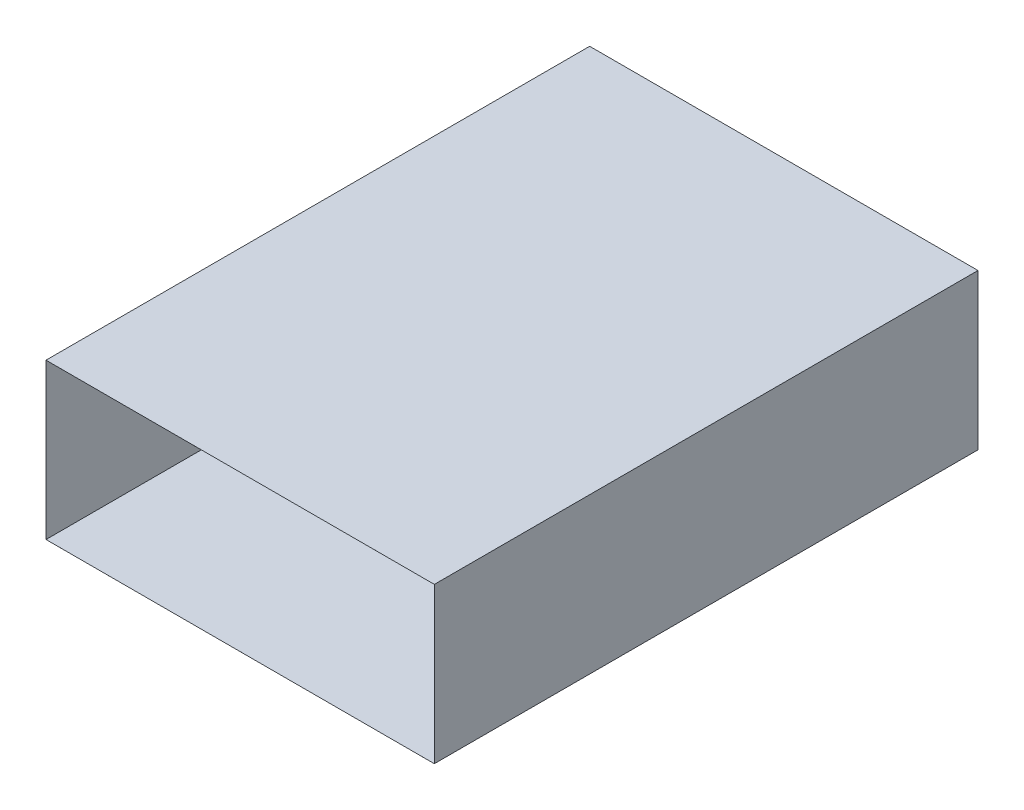
ISO-10303-21;
HEADER;
FILE_DESCRIPTION(('STEP AP214'),'2;1');
FILE_NAME('part.step','',(''),(''),'','','');
FILE_SCHEMA(('AUTOMOTIVE_DESIGN { 1 0 10303 214 1 1 1 1 }'));
ENDSEC;
DATA;
#1=APPLICATION_CONTEXT('core data for automotive mechanical design processes');
#2=APPLICATION_PROTOCOL_DEFINITION('international standard','automotive_design',2000,#1);
#3=PRODUCT_CONTEXT('',#1,'mechanical');
#4=PRODUCT('Part','Part','',(#3));
#5=PRODUCT_RELATED_PRODUCT_CATEGORY('part','',(#4));
#6=PRODUCT_DEFINITION_FORMATION('','',#4);
#7=PRODUCT_DEFINITION_CONTEXT('part definition',#1,'design');
#8=PRODUCT_DEFINITION('design','',#6,#7);
#9=PRODUCT_DEFINITION_SHAPE('','',#8);
#10=(LENGTH_UNIT() NAMED_UNIT(*) SI_UNIT(.MILLI.,.METRE.));
#11=(NAMED_UNIT(*) PLANE_ANGLE_UNIT() SI_UNIT($,.RADIAN.));
#12=(NAMED_UNIT(*) SI_UNIT($,.STERADIAN.) SOLID_ANGLE_UNIT());
#13=UNCERTAINTY_MEASURE_WITH_UNIT(LENGTH_MEASURE(1.E-05),#10,'distance_accuracy_value','');
#14=(GEOMETRIC_REPRESENTATION_CONTEXT(3) GLOBAL_UNCERTAINTY_ASSIGNED_CONTEXT((#13)) GLOBAL_UNIT_ASSIGNED_CONTEXT((#10,
#11,#12)) REPRESENTATION_CONTEXT('',''));
#15=CARTESIAN_POINT('',(0.,0.,0.));
#16=DIRECTION('',(0.,0.,1.));
#17=DIRECTION('',(1.,0.,0.));
#18=AXIS2_PLACEMENT_3D('',#15,#16,#17);
#19=CARTESIAN_POINT('',(0.,0.,350.));
#20=DIRECTION('',(0.,0.,1.));
#21=DIRECTION('',(1.,0.,0.));
#22=AXIS2_PLACEMENT_3D('',#19,#20,#21);
#23=PLANE('',#22);
#24=DIRECTION('',(0.,1.,0.));
#25=VECTOR('',#24,1.);
#26=CARTESIAN_POINT('',(125.001,0.,350.));
#27=LINE('',#26,#25);
#28=CARTESIAN_POINT('',(125.001,-50.001,350.));
#29=VERTEX_POINT('',#28);
#30=CARTESIAN_POINT('',(125.001,50.001,350.));
#31=VERTEX_POINT('',#30);
#32=EDGE_CURVE('E158',#29,#31,#27,.T.);
#33=ORIENTED_EDGE('',*,*,#32,.T.);
#34=DIRECTION('',(-1.,0.,0.));
#35=VECTOR('',#34,1.);
#36=CARTESIAN_POINT('',(0.,50.001,350.));
#37=LINE('',#36,#35);
#38=CARTESIAN_POINT('',(-125.001,50.001,350.));
#39=VERTEX_POINT('',#38);
#40=EDGE_CURVE('E161',#31,#39,#37,.T.);
#41=ORIENTED_EDGE('',*,*,#40,.T.);
#42=DIRECTION('',(0.,-1.,0.));
#43=VECTOR('',#42,1.);
#44=CARTESIAN_POINT('',(-125.001,0.,350.));
#45=LINE('',#44,#43);
#46=CARTESIAN_POINT('',(-125.001,-50.001,350.));
#47=VERTEX_POINT('',#46);
#48=EDGE_CURVE('E164',#39,#47,#45,.T.);
#49=ORIENTED_EDGE('',*,*,#48,.T.);
#50=DIRECTION('',(1.,0.,0.));
#51=VECTOR('',#50,1.);
#52=CARTESIAN_POINT('',(0.,-50.001,350.));
#53=LINE('',#52,#51);
#54=EDGE_CURVE('E166',#47,#29,#53,.T.);
#55=ORIENTED_EDGE('',*,*,#54,.T.);
#56=EDGE_LOOP('',(#33,#41,#49,#55));
#57=FACE_BOUND('',#56,.T.);
#58=DIRECTION('',(-1.,0.,0.));
#59=VECTOR('',#58,1.);
#60=CARTESIAN_POINT('',(-125.,50.,350.));
#61=LINE('',#60,#59);
#62=CARTESIAN_POINT('',(125.,50.,350.));
#63=VERTEX_POINT('',#62);
#64=CARTESIAN_POINT('',(-125.,50.,350.));
#65=VERTEX_POINT('',#64);
#66=EDGE_CURVE('E130',#63,#65,#61,.T.);
#67=ORIENTED_EDGE('',*,*,#66,.F.);
#68=DIRECTION('',(0.,1.,0.));
#69=VECTOR('',#68,1.);
#70=CARTESIAN_POINT('',(125.,-50.,350.));
#71=LINE('',#70,#69);
#72=CARTESIAN_POINT('',(125.,-50.,350.));
#73=VERTEX_POINT('',#72);
#74=EDGE_CURVE('E122',#73,#63,#71,.T.);
#75=ORIENTED_EDGE('',*,*,#74,.F.);
#76=DIRECTION('',(1.,0.,0.));
#77=VECTOR('',#76,1.);
#78=CARTESIAN_POINT('',(-125.,-50.,350.));
#79=LINE('',#78,#77);
#80=CARTESIAN_POINT('',(-125.,-50.,350.));
#81=VERTEX_POINT('',#80);
#82=EDGE_CURVE('E144',#81,#73,#79,.T.);
#83=ORIENTED_EDGE('',*,*,#82,.F.);
#84=DIRECTION('',(0.,-1.,0.));
#85=VECTOR('',#84,1.);
#86=CARTESIAN_POINT('',(-125.,-50.,350.));
#87=LINE('',#86,#85);
#88=EDGE_CURVE('E142',#65,#81,#87,.T.);
#89=ORIENTED_EDGE('',*,*,#88,.F.);
#90=EDGE_LOOP('',(#67,#75,#83,#89));
#91=FACE_BOUND('',#90,.T.);
#92=ADVANCED_FACE('F57',(#57,#91),#23,.T.);
#93=CARTESIAN_POINT('',(0.,0.,0.));
#94=DIRECTION('',(0.,0.,1.));
#95=DIRECTION('',(1.,0.,0.));
#96=AXIS2_PLACEMENT_3D('',#93,#94,#95);
#97=PLANE('',#96);
#98=DIRECTION('',(0.,1.,0.));
#99=VECTOR('',#98,1.);
#100=CARTESIAN_POINT('',(125.001,0.,0.));
#101=LINE('',#100,#99);
#102=CARTESIAN_POINT('',(125.001,-50.001,0.));
#103=VERTEX_POINT('',#102);
#104=CARTESIAN_POINT('',(125.001,50.001,0.));
#105=VERTEX_POINT('',#104);
#106=EDGE_CURVE('E138',#103,#105,#101,.T.);
#107=ORIENTED_EDGE('',*,*,#106,.F.);
#108=DIRECTION('',(1.,0.,0.));
#109=VECTOR('',#108,1.);
#110=CARTESIAN_POINT('',(0.,-50.001,0.));
#111=LINE('',#110,#109);
#112=CARTESIAN_POINT('',(-125.001,-50.001,0.));
#113=VERTEX_POINT('',#112);
#114=EDGE_CURVE('E162',#113,#103,#111,.T.);
#115=ORIENTED_EDGE('',*,*,#114,.F.);
#116=DIRECTION('',(0.,-1.,0.));
#117=VECTOR('',#116,1.);
#118=CARTESIAN_POINT('',(-125.001,0.,0.));
#119=LINE('',#118,#117);
#120=CARTESIAN_POINT('',(-125.001,50.001,0.));
#121=VERTEX_POINT('',#120);
#122=EDGE_CURVE('E173',#121,#113,#119,.T.);
#123=ORIENTED_EDGE('',*,*,#122,.F.);
#124=DIRECTION('',(-1.,0.,0.));
#125=VECTOR('',#124,1.);
#126=CARTESIAN_POINT('',(0.,50.001,0.));
#127=LINE('',#126,#125);
#128=EDGE_CURVE('E171',#105,#121,#127,.T.);
#129=ORIENTED_EDGE('',*,*,#128,.F.);
#130=EDGE_LOOP('',(#107,#115,#123,#129));
#131=FACE_BOUND('',#130,.T.);
#132=DIRECTION('',(0.,1.,0.));
#133=VECTOR('',#132,1.);
#134=CARTESIAN_POINT('',(125.,-50.,0.));
#135=LINE('',#134,#133);
#136=CARTESIAN_POINT('',(125.,-50.,0.));
#137=VERTEX_POINT('',#136);
#138=CARTESIAN_POINT('',(125.,50.,0.));
#139=VERTEX_POINT('',#138);
#140=EDGE_CURVE('E80',#137,#139,#135,.T.);
#141=ORIENTED_EDGE('',*,*,#140,.T.);
#142=DIRECTION('',(-1.,0.,0.));
#143=VECTOR('',#142,1.);
#144=CARTESIAN_POINT('',(-125.,50.,0.));
#145=LINE('',#144,#143);
#146=CARTESIAN_POINT('',(-125.,50.,0.));
#147=VERTEX_POINT('',#146);
#148=EDGE_CURVE('E137',#139,#147,#145,.T.);
#149=ORIENTED_EDGE('',*,*,#148,.T.);
#150=DIRECTION('',(0.,-1.,0.));
#151=VECTOR('',#150,1.);
#152=CARTESIAN_POINT('',(-125.,-50.,0.));
#153=LINE('',#152,#151);
#154=CARTESIAN_POINT('',(-125.,-50.,0.));
#155=VERTEX_POINT('',#154);
#156=EDGE_CURVE('E150',#147,#155,#153,.T.);
#157=ORIENTED_EDGE('',*,*,#156,.T.);
#158=DIRECTION('',(1.,0.,0.));
#159=VECTOR('',#158,1.);
#160=CARTESIAN_POINT('',(-125.,-50.,0.));
#161=LINE('',#160,#159);
#162=EDGE_CURVE('E131',#155,#137,#161,.T.);
#163=ORIENTED_EDGE('',*,*,#162,.T.);
#164=EDGE_LOOP('',(#141,#149,#157,#163));
#165=FACE_BOUND('',#164,.T.);
#166=ADVANCED_FACE('F191',(#131,#165),#97,.F.);
#167=CARTESIAN_POINT('',(125.001,0.,350.));
#168=DIRECTION('',(-1.,0.,0.));
#169=DIRECTION('',(0.,0.,1.));
#170=AXIS2_PLACEMENT_3D('',#167,#168,#169);
#171=PLANE('',#170);
#172=ORIENTED_EDGE('',*,*,#106,.T.);
#173=DIRECTION('',(0.,0.,-1.));
#174=VECTOR('',#173,1.);
#175=CARTESIAN_POINT('',(125.001,50.001,350.));
#176=LINE('',#175,#174);
#177=EDGE_CURVE('E12',#31,#105,#176,.T.);
#178=ORIENTED_EDGE('',*,*,#177,.F.);
#179=ORIENTED_EDGE('',*,*,#32,.F.);
#180=DIRECTION('',(0.,0.,-1.));
#181=VECTOR('',#180,1.);
#182=CARTESIAN_POINT('',(125.001,-50.001,350.));
#183=LINE('',#182,#181);
#184=EDGE_CURVE('E168',#29,#103,#183,.T.);
#185=ORIENTED_EDGE('',*,*,#184,.T.);
#186=EDGE_LOOP('',(#172,#178,#179,#185));
#187=FACE_BOUND('',#186,.T.);
#188=ADVANCED_FACE('F59',(#187),#171,.F.);
#189=CARTESIAN_POINT('',(0.,50.001,350.));
#190=DIRECTION('',(0.,-1.,0.));
#191=DIRECTION('',(0.,0.,-1.));
#192=AXIS2_PLACEMENT_3D('',#189,#190,#191);
#193=PLANE('',#192);
#194=ORIENTED_EDGE('',*,*,#128,.T.);
#195=DIRECTION('',(0.,0.,-1.));
#196=VECTOR('',#195,1.);
#197=CARTESIAN_POINT('',(-125.001,50.001,350.));
#198=LINE('',#197,#196);
#199=EDGE_CURVE('E65',#39,#121,#198,.T.);
#200=ORIENTED_EDGE('',*,*,#199,.F.);
#201=ORIENTED_EDGE('',*,*,#40,.F.);
#202=ORIENTED_EDGE('',*,*,#177,.T.);
#203=EDGE_LOOP('',(#194,#200,#201,#202));
#204=FACE_BOUND('',#203,.T.);
#205=ADVANCED_FACE('F201',(#204),#193,.F.);
#206=CARTESIAN_POINT('',(-125.001,0.,350.));
#207=DIRECTION('',(1.,0.,0.));
#208=DIRECTION('',(0.,0.,-1.));
#209=AXIS2_PLACEMENT_3D('',#206,#207,#208);
#210=PLANE('',#209);
#211=ORIENTED_EDGE('',*,*,#122,.T.);
#212=DIRECTION('',(0.,0.,-1.));
#213=VECTOR('',#212,1.);
#214=CARTESIAN_POINT('',(-125.001,-50.001,350.));
#215=LINE('',#214,#213);
#216=EDGE_CURVE('E178',#47,#113,#215,.T.);
#217=ORIENTED_EDGE('',*,*,#216,.F.);
#218=ORIENTED_EDGE('',*,*,#48,.F.);
#219=ORIENTED_EDGE('',*,*,#199,.T.);
#220=EDGE_LOOP('',(#211,#217,#218,#219));
#221=FACE_BOUND('',#220,.T.);
#222=ADVANCED_FACE('F185',(#221),#210,.F.);
#223=CARTESIAN_POINT('',(0.,-50.001,350.));
#224=DIRECTION('',(0.,1.,0.));
#225=DIRECTION('',(0.,0.,1.));
#226=AXIS2_PLACEMENT_3D('',#223,#224,#225);
#227=PLANE('',#226);
#228=ORIENTED_EDGE('',*,*,#114,.T.);
#229=ORIENTED_EDGE('',*,*,#184,.F.);
#230=ORIENTED_EDGE('',*,*,#54,.F.);
#231=ORIENTED_EDGE('',*,*,#216,.T.);
#232=EDGE_LOOP('',(#228,#229,#230,#231));
#233=FACE_BOUND('',#232,.T.);
#234=ADVANCED_FACE('F195',(#233),#227,.F.);
#235=CARTESIAN_POINT('',(125.,-50.,350.));
#236=DIRECTION('',(-1.,0.,0.));
#237=DIRECTION('',(0.,0.,1.));
#238=AXIS2_PLACEMENT_3D('',#235,#236,#237);
#239=PLANE('',#238);
#240=ORIENTED_EDGE('',*,*,#140,.F.);
#241=DIRECTION('',(0.,0.,-1.));
#242=VECTOR('',#241,1.);
#243=CARTESIAN_POINT('',(125.,-50.,350.));
#244=LINE('',#243,#242);
#245=EDGE_CURVE('E126',#73,#137,#244,.T.);
#246=ORIENTED_EDGE('',*,*,#245,.F.);
#247=ORIENTED_EDGE('',*,*,#74,.T.);
#248=DIRECTION('',(0.,0.,-1.));
#249=VECTOR('',#248,1.);
#250=CARTESIAN_POINT('',(125.,50.,350.));
#251=LINE('',#250,#249);
#252=EDGE_CURVE('E125',#63,#139,#251,.T.);
#253=ORIENTED_EDGE('',*,*,#252,.T.);
#254=EDGE_LOOP('',(#240,#246,#247,#253));
#255=FACE_BOUND('',#254,.T.);
#256=ADVANCED_FACE('F124',(#255),#239,.T.);
#257=CARTESIAN_POINT('',(-125.,50.,350.));
#258=DIRECTION('',(0.,-1.,0.));
#259=DIRECTION('',(0.,0.,-1.));
#260=AXIS2_PLACEMENT_3D('',#257,#258,#259);
#261=PLANE('',#260);
#262=ORIENTED_EDGE('',*,*,#148,.F.);
#263=ORIENTED_EDGE('',*,*,#252,.F.);
#264=ORIENTED_EDGE('',*,*,#66,.T.);
#265=DIRECTION('',(0.,0.,-1.));
#266=VECTOR('',#265,1.);
#267=CARTESIAN_POINT('',(-125.,50.,350.));
#268=LINE('',#267,#266);
#269=EDGE_CURVE('E139',#65,#147,#268,.T.);
#270=ORIENTED_EDGE('',*,*,#269,.T.);
#271=EDGE_LOOP('',(#262,#263,#264,#270));
#272=FACE_BOUND('',#271,.T.);
#273=ADVANCED_FACE('F134',(#272),#261,.T.);
#274=CARTESIAN_POINT('',(-125.,-50.,350.));
#275=DIRECTION('',(1.,0.,0.));
#276=DIRECTION('',(0.,0.,-1.));
#277=AXIS2_PLACEMENT_3D('',#274,#275,#276);
#278=PLANE('',#277);
#279=ORIENTED_EDGE('',*,*,#156,.F.);
#280=ORIENTED_EDGE('',*,*,#269,.F.);
#281=ORIENTED_EDGE('',*,*,#88,.T.);
#282=DIRECTION('',(0.,0.,-1.));
#283=VECTOR('',#282,1.);
#284=CARTESIAN_POINT('',(-125.,-50.,350.));
#285=LINE('',#284,#283);
#286=EDGE_CURVE('E72',#81,#155,#285,.T.);
#287=ORIENTED_EDGE('',*,*,#286,.T.);
#288=EDGE_LOOP('',(#279,#280,#281,#287));
#289=FACE_BOUND('',#288,.T.);
#290=ADVANCED_FACE('F224',(#289),#278,.T.);
#291=CARTESIAN_POINT('',(-125.,-50.,350.));
#292=DIRECTION('',(0.,1.,0.));
#293=DIRECTION('',(0.,0.,1.));
#294=AXIS2_PLACEMENT_3D('',#291,#292,#293);
#295=PLANE('',#294);
#296=ORIENTED_EDGE('',*,*,#162,.F.);
#297=ORIENTED_EDGE('',*,*,#286,.F.);
#298=ORIENTED_EDGE('',*,*,#82,.T.);
#299=ORIENTED_EDGE('',*,*,#245,.T.);
#300=EDGE_LOOP('',(#296,#297,#298,#299));
#301=FACE_BOUND('',#300,.T.);
#302=ADVANCED_FACE('F228',(#301),#295,.T.);
#303=CLOSED_SHELL('',(#92,#166,#188,#205,#222,#234,#256,#273,#290,#302));
#304=MANIFOLD_SOLID_BREP('B2',#303);
#305=ADVANCED_BREP_SHAPE_REPRESENTATION('',(#18,#304),#14);
#306=SHAPE_DEFINITION_REPRESENTATION(#9,#305);
ENDSEC;
END-ISO-10303-21;
